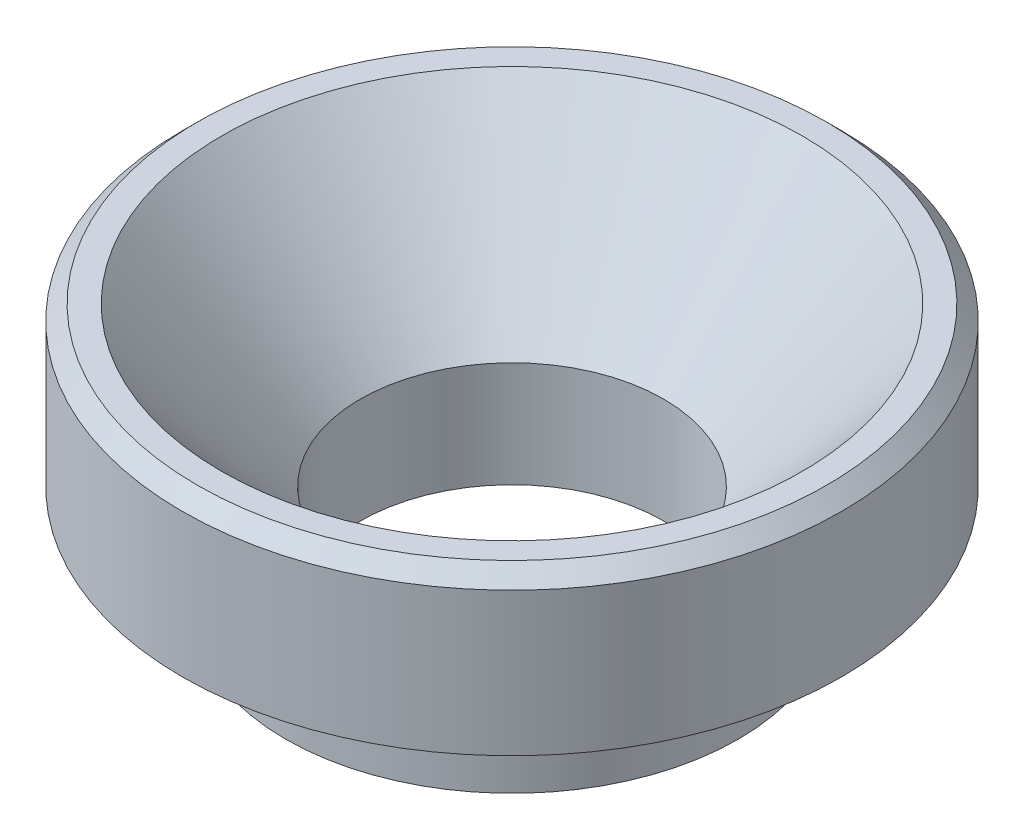
ISO-10303-21;
HEADER;
FILE_DESCRIPTION(('STEP AP214'),'2;1');
FILE_NAME('part.step','',(''),(''),'','','');
FILE_SCHEMA(('AUTOMOTIVE_DESIGN { 1 0 10303 214 1 1 1 1 }'));
ENDSEC;
DATA;
#1=APPLICATION_CONTEXT('core data for automotive mechanical design processes');
#2=APPLICATION_PROTOCOL_DEFINITION('international standard','automotive_design',2000,#1);
#3=PRODUCT_CONTEXT('',#1,'mechanical');
#4=PRODUCT('Part','Part','',(#3));
#5=PRODUCT_RELATED_PRODUCT_CATEGORY('part','',(#4));
#6=PRODUCT_DEFINITION_FORMATION('','',#4);
#7=PRODUCT_DEFINITION_CONTEXT('part definition',#1,'design');
#8=PRODUCT_DEFINITION('design','',#6,#7);
#9=PRODUCT_DEFINITION_SHAPE('','',#8);
#10=(LENGTH_UNIT() NAMED_UNIT(*) SI_UNIT(.MILLI.,.METRE.));
#11=(NAMED_UNIT(*) PLANE_ANGLE_UNIT() SI_UNIT($,.RADIAN.));
#12=(NAMED_UNIT(*) SI_UNIT($,.STERADIAN.) SOLID_ANGLE_UNIT());
#13=UNCERTAINTY_MEASURE_WITH_UNIT(LENGTH_MEASURE(1.E-05),#10,'distance_accuracy_value','');
#14=(GEOMETRIC_REPRESENTATION_CONTEXT(3) GLOBAL_UNCERTAINTY_ASSIGNED_CONTEXT((#13)) GLOBAL_UNIT_ASSIGNED_CONTEXT((#10,
#11,#12)) REPRESENTATION_CONTEXT('',''));
#15=CARTESIAN_POINT('',(0.,0.,0.));
#16=DIRECTION('',(0.,0.,1.));
#17=DIRECTION('',(1.,0.,0.));
#18=AXIS2_PLACEMENT_3D('',#15,#16,#17);
#19=CARTESIAN_POINT('',(3.81,0.,0.));
#20=DIRECTION('',(0.,-1.,0.));
#21=DIRECTION('',(0.,0.,-1.));
#22=AXIS2_PLACEMENT_3D('',#19,#20,#21);
#23=PLANE('',#22);
#24=CARTESIAN_POINT('',(0.,0.,0.));
#25=DIRECTION('',(0.,-1.,0.));
#26=DIRECTION('',(0.,0.,-1.));
#27=AXIS2_PLACEMENT_3D('',#24,#25,#26);
#28=CIRCLE('',#27,3.81);
#29=CARTESIAN_POINT('',(0.,0.,-3.81));
#30=VERTEX_POINT('',#29);
#31=EDGE_CURVE('E59',#30,#30,#28,.T.);
#32=ORIENTED_EDGE('',*,*,#31,.T.);
#33=EDGE_LOOP('',(#32));
#34=FACE_BOUND('',#33,.T.);
#35=CARTESIAN_POINT('',(0.,0.,0.));
#36=DIRECTION('',(0.,-1.,0.));
#37=DIRECTION('',(0.,0.,-1.));
#38=AXIS2_PLACEMENT_3D('',#35,#36,#37);
#39=CIRCLE('',#38,2.5527);
#40=CARTESIAN_POINT('',(0.,0.,-2.5527));
#41=VERTEX_POINT('',#40);
#42=EDGE_CURVE('E73',#41,#41,#39,.T.);
#43=ORIENTED_EDGE('',*,*,#42,.F.);
#44=EDGE_LOOP('',(#43));
#45=FACE_BOUND('',#44,.T.);
#46=ADVANCED_FACE('F34',(#34,#45),#23,.T.);
#47=CARTESIAN_POINT('',(0.,0.,0.));
#48=DIRECTION('',(0.,-1.,0.));
#49=DIRECTION('',(0.,0.,-1.));
#50=AXIS2_PLACEMENT_3D('',#47,#48,#49);
#51=CYLINDRICAL_SURFACE('',#50,3.81);
#52=CARTESIAN_POINT('',(0.,1.651,0.));
#53=DIRECTION('',(0.,-1.,0.));
#54=DIRECTION('',(0.,0.,-1.));
#55=AXIS2_PLACEMENT_3D('',#52,#53,#54);
#56=CIRCLE('',#55,3.81);
#57=CARTESIAN_POINT('',(0.,1.651,-3.81));
#58=VERTEX_POINT('',#57);
#59=EDGE_CURVE('E41',#58,#58,#56,.T.);
#60=ORIENTED_EDGE('',*,*,#59,.T.);
#61=EDGE_LOOP('',(#60));
#62=FACE_BOUND('',#61,.T.);
#63=ORIENTED_EDGE('',*,*,#31,.F.);
#64=EDGE_LOOP('',(#63));
#65=FACE_BOUND('',#64,.T.);
#66=ADVANCED_FACE('F82',(#62,#65),#51,.T.);
#67=CARTESIAN_POINT('',(5.5499,1.778,0.));
#68=DIRECTION('',(0.,-1.,0.));
#69=DIRECTION('',(0.,0.,-1.));
#70=AXIS2_PLACEMENT_3D('',#67,#68,#69);
#71=PLANE('',#70);
#72=CARTESIAN_POINT('',(0.,1.778,0.));
#73=DIRECTION('',(0.,-1.,0.));
#74=DIRECTION('',(0.,0.,-1.));
#75=AXIS2_PLACEMENT_3D('',#72,#73,#74);
#76=CIRCLE('',#75,3.937);
#77=CARTESIAN_POINT('',(0.,1.778,-3.937));
#78=VERTEX_POINT('',#77);
#79=EDGE_CURVE('E10',#78,#78,#76,.F.);
#80=ORIENTED_EDGE('',*,*,#79,.T.);
#81=EDGE_LOOP('',(#80));
#82=FACE_BOUND('',#81,.T.);
#83=CARTESIAN_POINT('',(0.,1.778,0.));
#84=DIRECTION('',(0.,-1.,0.));
#85=DIRECTION('',(0.,0.,-1.));
#86=AXIS2_PLACEMENT_3D('',#83,#84,#85);
#87=CIRCLE('',#86,5.5499);
#88=CARTESIAN_POINT('',(0.,1.778,-5.5499));
#89=VERTEX_POINT('',#88);
#90=EDGE_CURVE('E62',#89,#89,#87,.T.);
#91=ORIENTED_EDGE('',*,*,#90,.T.);
#92=EDGE_LOOP('',(#91));
#93=FACE_BOUND('',#92,.T.);
#94=ADVANCED_FACE('F87',(#82,#93),#71,.T.);
#95=CARTESIAN_POINT('',(0.,0.,0.));
#96=DIRECTION('',(0.,-1.,0.));
#97=DIRECTION('',(0.,0.,-1.));
#98=AXIS2_PLACEMENT_3D('',#95,#96,#97);
#99=CYLINDRICAL_SURFACE('',#98,5.5499);
#100=CARTESIAN_POINT('',(0.,4.191,0.));
#101=DIRECTION('',(0.,1.,0.));
#102=DIRECTION('',(0.,0.,1.));
#103=AXIS2_PLACEMENT_3D('',#100,#101,#102);
#104=CIRCLE('',#103,5.5499);
#105=CARTESIAN_POINT('',(0.,4.191,5.5499));
#106=VERTEX_POINT('',#105);
#107=EDGE_CURVE('E53',#106,#106,#104,.F.);
#108=ORIENTED_EDGE('',*,*,#107,.T.);
#109=EDGE_LOOP('',(#108));
#110=FACE_BOUND('',#109,.T.);
#111=ORIENTED_EDGE('',*,*,#90,.F.);
#112=EDGE_LOOP('',(#111));
#113=FACE_BOUND('',#112,.T.);
#114=ADVANCED_FACE('F93',(#110,#113),#99,.T.);
#115=CARTESIAN_POINT('',(4.8895,4.445,0.));
#116=DIRECTION('',(0.,1.,0.));
#117=DIRECTION('',(0.,0.,1.));
#118=AXIS2_PLACEMENT_3D('',#115,#116,#117);
#119=PLANE('',#118);
#120=CARTESIAN_POINT('',(0.,4.445,0.));
#121=DIRECTION('',(0.,1.,0.));
#122=DIRECTION('',(0.,0.,1.));
#123=AXIS2_PLACEMENT_3D('',#120,#121,#122);
#124=CIRCLE('',#123,5.2959);
#125=CARTESIAN_POINT('',(0.,4.445,5.2959));
#126=VERTEX_POINT('',#125);
#127=EDGE_CURVE('E48',#126,#126,#124,.T.);
#128=ORIENTED_EDGE('',*,*,#127,.T.);
#129=EDGE_LOOP('',(#128));
#130=FACE_BOUND('',#129,.T.);
#131=CARTESIAN_POINT('',(0.,4.445,0.));
#132=DIRECTION('',(0.,-1.,0.));
#133=DIRECTION('',(0.,0.,-1.));
#134=AXIS2_PLACEMENT_3D('',#131,#132,#133);
#135=CIRCLE('',#134,4.8895);
#136=CARTESIAN_POINT('',(0.,4.445,-4.8895));
#137=VERTEX_POINT('',#136);
#138=EDGE_CURVE('E66',#137,#137,#135,.T.);
#139=ORIENTED_EDGE('',*,*,#138,.T.);
#140=EDGE_LOOP('',(#139));
#141=FACE_BOUND('',#140,.T.);
#142=ADVANCED_FACE('F98',(#130,#141),#119,.T.);
#143=CARTESIAN_POINT('',(0.,4.445,0.));
#144=DIRECTION('',(0.,1.,0.));
#145=DIRECTION('',(0.,0.,1.));
#146=AXIS2_PLACEMENT_3D('',#143,#144,#145);
#147=CONICAL_SURFACE('',#146,4.8895,0.719503853967069);
#148=CARTESIAN_POINT('',(0.,1.778,0.));
#149=DIRECTION('',(0.,-1.,0.));
#150=DIRECTION('',(0.,0.,-1.));
#151=AXIS2_PLACEMENT_3D('',#148,#149,#150);
#152=CIRCLE('',#151,2.5527);
#153=CARTESIAN_POINT('',(0.,1.778,-2.5527));
#154=VERTEX_POINT('',#153);
#155=EDGE_CURVE('E69',#154,#154,#152,.T.);
#156=ORIENTED_EDGE('',*,*,#155,.T.);
#157=EDGE_LOOP('',(#156));
#158=FACE_BOUND('',#157,.T.);
#159=ORIENTED_EDGE('',*,*,#138,.F.);
#160=EDGE_LOOP('',(#159));
#161=FACE_BOUND('',#160,.T.);
#162=ADVANCED_FACE('F102',(#158,#161),#147,.F.);
#163=CARTESIAN_POINT('',(0.,0.,0.));
#164=DIRECTION('',(0.,-1.,0.));
#165=DIRECTION('',(0.,0.,-1.));
#166=AXIS2_PLACEMENT_3D('',#163,#164,#165);
#167=CYLINDRICAL_SURFACE('',#166,2.5527);
#168=ORIENTED_EDGE('',*,*,#42,.T.);
#169=EDGE_LOOP('',(#168));
#170=FACE_BOUND('',#169,.T.);
#171=ORIENTED_EDGE('',*,*,#155,.F.);
#172=EDGE_LOOP('',(#171));
#173=FACE_BOUND('',#172,.T.);
#174=ADVANCED_FACE('F78',(#170,#173),#167,.F.);
#175=CARTESIAN_POINT('',(0.,4.191,0.));
#176=DIRECTION('',(0.,-1.,0.));
#177=DIRECTION('',(0.,0.,-1.));
#178=AXIS2_PLACEMENT_3D('',#175,#176,#177);
#179=CONICAL_SURFACE('',#178,5.5499,0.785398163397448);
#180=ORIENTED_EDGE('',*,*,#127,.F.);
#181=EDGE_LOOP('',(#180));
#182=FACE_BOUND('',#181,.T.);
#183=ORIENTED_EDGE('',*,*,#107,.F.);
#184=EDGE_LOOP('',(#183));
#185=FACE_BOUND('',#184,.T.);
#186=ADVANCED_FACE('F109',(#182,#185),#179,.T.);
#187=CARTESIAN_POINT('',(0.,1.651,0.));
#188=DIRECTION('',(0.,-1.,0.));
#189=DIRECTION('',(0.,0.,-1.));
#190=AXIS2_PLACEMENT_3D('',#187,#188,#189);
#191=TOROIDAL_SURFACE('',#190,3.937,0.127);
#192=ORIENTED_EDGE('',*,*,#79,.F.);
#193=EDGE_LOOP('',(#192));
#194=FACE_BOUND('',#193,.T.);
#195=ORIENTED_EDGE('',*,*,#59,.F.);
#196=EDGE_LOOP('',(#195));
#197=FACE_BOUND('',#196,.T.);
#198=ADVANCED_FACE('F112',(#194,#197),#191,.F.);
#199=CLOSED_SHELL('',(#46,#66,#94,#114,#142,#162,#174,#186,#198));
#200=MANIFOLD_SOLID_BREP('B2',#199);
#201=ADVANCED_BREP_SHAPE_REPRESENTATION('',(#18,#200),#14);
#202=SHAPE_DEFINITION_REPRESENTATION(#9,#201);
ENDSEC;
END-ISO-10303-21;
